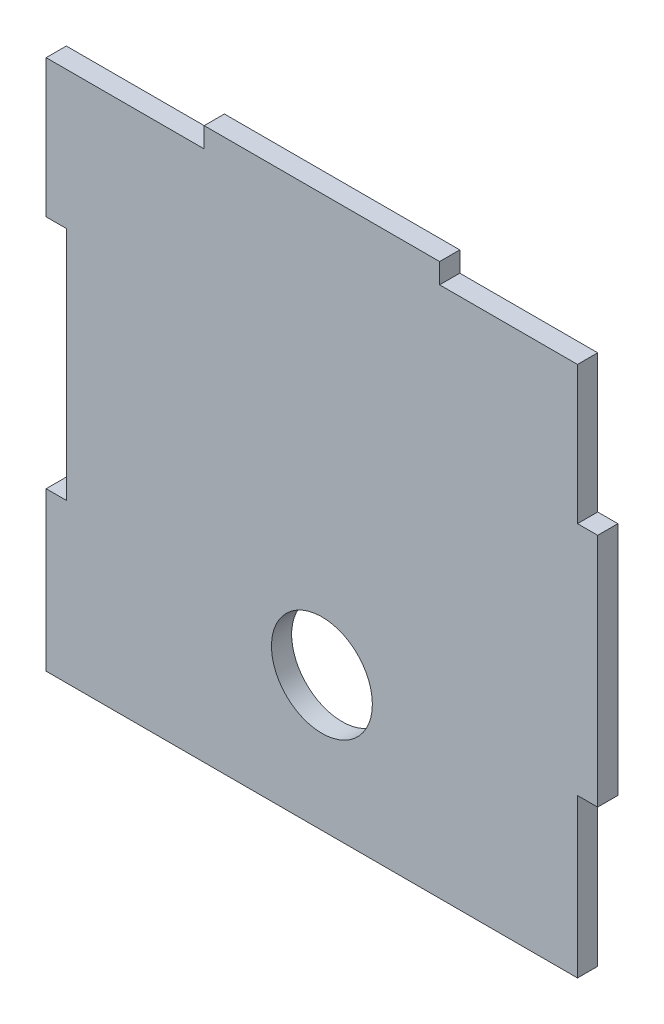
ISO-10303-21;
HEADER;
FILE_DESCRIPTION(('STEP AP214'),'2;1');
FILE_NAME('part.step','',(''),(''),'','','');
FILE_SCHEMA(('AUTOMOTIVE_DESIGN { 1 0 10303 214 1 1 1 1 }'));
ENDSEC;
DATA;
#1=APPLICATION_CONTEXT('core data for automotive mechanical design processes');
#2=APPLICATION_PROTOCOL_DEFINITION('international standard','automotive_design',2000,#1);
#3=PRODUCT_CONTEXT('',#1,'mechanical');
#4=PRODUCT('Part','Part','',(#3));
#5=PRODUCT_RELATED_PRODUCT_CATEGORY('part','',(#4));
#6=PRODUCT_DEFINITION_FORMATION('','',#4);
#7=PRODUCT_DEFINITION_CONTEXT('part definition',#1,'design');
#8=PRODUCT_DEFINITION('design','',#6,#7);
#9=PRODUCT_DEFINITION_SHAPE('','',#8);
#10=(LENGTH_UNIT() NAMED_UNIT(*) SI_UNIT(.MILLI.,.METRE.));
#11=(NAMED_UNIT(*) PLANE_ANGLE_UNIT() SI_UNIT($,.RADIAN.));
#12=(NAMED_UNIT(*) SI_UNIT($,.STERADIAN.) SOLID_ANGLE_UNIT());
#13=UNCERTAINTY_MEASURE_WITH_UNIT(LENGTH_MEASURE(1.E-05),#10,'distance_accuracy_value','');
#14=(GEOMETRIC_REPRESENTATION_CONTEXT(3) GLOBAL_UNCERTAINTY_ASSIGNED_CONTEXT((#13)) GLOBAL_UNIT_ASSIGNED_CONTEXT((#10,
#11,#12)) REPRESENTATION_CONTEXT('',''));
#15=CARTESIAN_POINT('',(0.,0.,0.));
#16=DIRECTION('',(0.,0.,1.));
#17=DIRECTION('',(1.,0.,0.));
#18=AXIS2_PLACEMENT_3D('',#15,#16,#17);
#19=CARTESIAN_POINT('',(38.,-16.,3.));
#20=DIRECTION('',(0.,1.,0.));
#21=DIRECTION('',(-1.,0.,0.));
#22=AXIS2_PLACEMENT_3D('',#19,#20,#21);
#23=PLANE('',#22);
#24=DIRECTION('',(1.,0.,0.));
#25=VECTOR('',#24,1.);
#26=CARTESIAN_POINT('',(38.,-16.,0.));
#27=LINE('',#26,#25);
#28=CARTESIAN_POINT('',(38.,-16.,0.));
#29=VERTEX_POINT('',#28);
#30=CARTESIAN_POINT('',(41.,-16.,0.));
#31=VERTEX_POINT('',#30);
#32=EDGE_CURVE('E187',#29,#31,#27,.T.);
#33=ORIENTED_EDGE('',*,*,#32,.T.);
#34=DIRECTION('',(0.,0.,-1.));
#35=VECTOR('',#34,1.);
#36=CARTESIAN_POINT('',(41.,-16.,3.));
#37=LINE('',#36,#35);
#38=CARTESIAN_POINT('',(41.,-16.,3.));
#39=VERTEX_POINT('',#38);
#40=EDGE_CURVE('E11',#39,#31,#37,.T.);
#41=ORIENTED_EDGE('',*,*,#40,.F.);
#42=DIRECTION('',(1.,0.,0.));
#43=VECTOR('',#42,1.);
#44=CARTESIAN_POINT('',(38.,-16.,3.));
#45=LINE('',#44,#43);
#46=CARTESIAN_POINT('',(38.,-16.,3.));
#47=VERTEX_POINT('',#46);
#48=EDGE_CURVE('E238',#47,#39,#45,.T.);
#49=ORIENTED_EDGE('',*,*,#48,.F.);
#50=DIRECTION('',(0.,0.,-1.));
#51=VECTOR('',#50,1.);
#52=CARTESIAN_POINT('',(38.,-16.,3.));
#53=LINE('',#52,#51);
#54=EDGE_CURVE('E183',#47,#29,#53,.T.);
#55=ORIENTED_EDGE('',*,*,#54,.T.);
#56=EDGE_LOOP('',(#33,#41,#49,#55));
#57=FACE_BOUND('',#56,.T.);
#58=ADVANCED_FACE('F38',(#57),#23,.F.);
#59=CARTESIAN_POINT('',(41.,16.,3.));
#60=DIRECTION('',(-1.,0.,0.));
#61=DIRECTION('',(0.,0.,1.));
#62=AXIS2_PLACEMENT_3D('',#59,#60,#61);
#63=PLANE('',#62);
#64=DIRECTION('',(0.,1.,0.));
#65=VECTOR('',#64,1.);
#66=CARTESIAN_POINT('',(41.,16.,0.));
#67=LINE('',#66,#65);
#68=CARTESIAN_POINT('',(41.,19.,0.));
#69=VERTEX_POINT('',#68);
#70=EDGE_CURVE('E191',#31,#69,#67,.T.);
#71=ORIENTED_EDGE('',*,*,#70,.T.);
#72=DIRECTION('',(0.,0.,-1.));
#73=VECTOR('',#72,1.);
#74=CARTESIAN_POINT('',(41.,19.,3.));
#75=LINE('',#74,#73);
#76=CARTESIAN_POINT('',(41.,19.,3.));
#77=VERTEX_POINT('',#76);
#78=EDGE_CURVE('E47',#77,#69,#75,.T.);
#79=ORIENTED_EDGE('',*,*,#78,.F.);
#80=DIRECTION('',(0.,1.,0.));
#81=VECTOR('',#80,1.);
#82=CARTESIAN_POINT('',(41.,16.,3.));
#83=LINE('',#82,#81);
#84=EDGE_CURVE('E120',#39,#77,#83,.T.);
#85=ORIENTED_EDGE('',*,*,#84,.F.);
#86=ORIENTED_EDGE('',*,*,#40,.T.);
#87=EDGE_LOOP('',(#71,#79,#85,#86));
#88=FACE_BOUND('',#87,.T.);
#89=ADVANCED_FACE('F379',(#88),#63,.F.);
#90=CARTESIAN_POINT('',(41.,19.,3.));
#91=DIRECTION('',(0.,-1.,0.));
#92=DIRECTION('',(0.,0.,-1.));
#93=AXIS2_PLACEMENT_3D('',#90,#91,#92);
#94=PLANE('',#93);
#95=DIRECTION('',(-1.,0.,0.));
#96=VECTOR('',#95,1.);
#97=CARTESIAN_POINT('',(41.,19.,0.));
#98=LINE('',#97,#96);
#99=CARTESIAN_POINT('',(38.,19.,0.));
#100=VERTEX_POINT('',#99);
#101=EDGE_CURVE('E195',#69,#100,#98,.T.);
#102=ORIENTED_EDGE('',*,*,#101,.T.);
#103=DIRECTION('',(0.,0.,-1.));
#104=VECTOR('',#103,1.);
#105=CARTESIAN_POINT('',(38.,19.,3.));
#106=LINE('',#105,#104);
#107=CARTESIAN_POINT('',(38.,19.,3.));
#108=VERTEX_POINT('',#107);
#109=EDGE_CURVE('E281',#108,#100,#106,.T.);
#110=ORIENTED_EDGE('',*,*,#109,.F.);
#111=DIRECTION('',(-1.,0.,0.));
#112=VECTOR('',#111,1.);
#113=CARTESIAN_POINT('',(41.,19.,3.));
#114=LINE('',#113,#112);
#115=EDGE_CURVE('E291',#77,#108,#114,.T.);
#116=ORIENTED_EDGE('',*,*,#115,.F.);
#117=ORIENTED_EDGE('',*,*,#78,.T.);
#118=EDGE_LOOP('',(#102,#110,#116,#117));
#119=FACE_BOUND('',#118,.T.);
#120=ADVANCED_FACE('F289',(#119),#94,.F.);
#121=CARTESIAN_POINT('',(38.,39.5,3.));
#122=DIRECTION('',(-1.,0.,0.));
#123=DIRECTION('',(0.,-1.,0.));
#124=AXIS2_PLACEMENT_3D('',#121,#122,#123);
#125=PLANE('',#124);
#126=DIRECTION('',(0.,1.,0.));
#127=VECTOR('',#126,1.);
#128=CARTESIAN_POINT('',(38.,39.5,0.));
#129=LINE('',#128,#127);
#130=CARTESIAN_POINT('',(38.,39.5,0.));
#131=VERTEX_POINT('',#130);
#132=EDGE_CURVE('E198',#100,#131,#129,.T.);
#133=ORIENTED_EDGE('',*,*,#132,.T.);
#134=DIRECTION('',(0.,0.,-1.));
#135=VECTOR('',#134,1.);
#136=CARTESIAN_POINT('',(38.,39.5,3.));
#137=LINE('',#136,#135);
#138=CARTESIAN_POINT('',(38.,39.5,3.));
#139=VERTEX_POINT('',#138);
#140=EDGE_CURVE('E277',#139,#131,#137,.T.);
#141=ORIENTED_EDGE('',*,*,#140,.F.);
#142=DIRECTION('',(0.,1.,0.));
#143=VECTOR('',#142,1.);
#144=CARTESIAN_POINT('',(38.,39.5,3.));
#145=LINE('',#144,#143);
#146=EDGE_CURVE('E308',#108,#139,#145,.T.);
#147=ORIENTED_EDGE('',*,*,#146,.F.);
#148=ORIENTED_EDGE('',*,*,#109,.T.);
#149=EDGE_LOOP('',(#133,#141,#147,#148));
#150=FACE_BOUND('',#149,.T.);
#151=ADVANCED_FACE('F298',(#150),#125,.F.);
#152=CARTESIAN_POINT('',(17.5,39.5,3.));
#153=DIRECTION('',(0.,-1.,0.));
#154=DIRECTION('',(1.,0.,0.));
#155=AXIS2_PLACEMENT_3D('',#152,#153,#154);
#156=PLANE('',#155);
#157=DIRECTION('',(-1.,0.,0.));
#158=VECTOR('',#157,1.);
#159=CARTESIAN_POINT('',(17.5,39.5,0.));
#160=LINE('',#159,#158);
#161=CARTESIAN_POINT('',(17.5,39.5,0.));
#162=VERTEX_POINT('',#161);
#163=EDGE_CURVE('E201',#131,#162,#160,.T.);
#164=ORIENTED_EDGE('',*,*,#163,.T.);
#165=DIRECTION('',(0.,0.,-1.));
#166=VECTOR('',#165,1.);
#167=CARTESIAN_POINT('',(17.5,39.5,3.));
#168=LINE('',#167,#166);
#169=CARTESIAN_POINT('',(17.5,39.5,3.));
#170=VERTEX_POINT('',#169);
#171=EDGE_CURVE('E273',#170,#162,#168,.T.);
#172=ORIENTED_EDGE('',*,*,#171,.F.);
#173=DIRECTION('',(-1.,0.,0.));
#174=VECTOR('',#173,1.);
#175=CARTESIAN_POINT('',(17.5,39.5,3.));
#176=LINE('',#175,#174);
#177=EDGE_CURVE('E304',#139,#170,#176,.T.);
#178=ORIENTED_EDGE('',*,*,#177,.F.);
#179=ORIENTED_EDGE('',*,*,#140,.T.);
#180=EDGE_LOOP('',(#164,#172,#178,#179));
#181=FACE_BOUND('',#180,.T.);
#182=ADVANCED_FACE('F302',(#181),#156,.F.);
#183=CARTESIAN_POINT('',(17.5,42.5,3.));
#184=DIRECTION('',(-1.,0.,0.));
#185=DIRECTION('',(0.,-1.,0.));
#186=AXIS2_PLACEMENT_3D('',#183,#184,#185);
#187=PLANE('',#186);
#188=DIRECTION('',(0.,1.,0.));
#189=VECTOR('',#188,1.);
#190=CARTESIAN_POINT('',(17.5,42.5,0.));
#191=LINE('',#190,#189);
#192=CARTESIAN_POINT('',(17.5,42.5,0.));
#193=VERTEX_POINT('',#192);
#194=EDGE_CURVE('E204',#162,#193,#191,.T.);
#195=ORIENTED_EDGE('',*,*,#194,.T.);
#196=DIRECTION('',(0.,0.,-1.));
#197=VECTOR('',#196,1.);
#198=CARTESIAN_POINT('',(17.5,42.5,3.));
#199=LINE('',#198,#197);
#200=CARTESIAN_POINT('',(17.5,42.5,3.));
#201=VERTEX_POINT('',#200);
#202=EDGE_CURVE('E269',#201,#193,#199,.T.);
#203=ORIENTED_EDGE('',*,*,#202,.F.);
#204=DIRECTION('',(0.,1.,0.));
#205=VECTOR('',#204,1.);
#206=CARTESIAN_POINT('',(17.5,42.5,3.));
#207=LINE('',#206,#205);
#208=EDGE_CURVE('E307',#170,#201,#207,.T.);
#209=ORIENTED_EDGE('',*,*,#208,.F.);
#210=ORIENTED_EDGE('',*,*,#171,.T.);
#211=EDGE_LOOP('',(#195,#203,#209,#210));
#212=FACE_BOUND('',#211,.T.);
#213=ADVANCED_FACE('F392',(#212),#187,.F.);
#214=CARTESIAN_POINT('',(-17.5,42.5,3.));
#215=DIRECTION('',(0.,-1.,0.));
#216=DIRECTION('',(0.,0.,-1.));
#217=AXIS2_PLACEMENT_3D('',#214,#215,#216);
#218=PLANE('',#217);
#219=DIRECTION('',(-1.,0.,0.));
#220=VECTOR('',#219,1.);
#221=CARTESIAN_POINT('',(-17.5,42.5,0.));
#222=LINE('',#221,#220);
#223=CARTESIAN_POINT('',(-17.5,42.5,0.));
#224=VERTEX_POINT('',#223);
#225=EDGE_CURVE('E207',#193,#224,#222,.T.);
#226=ORIENTED_EDGE('',*,*,#225,.T.);
#227=DIRECTION('',(0.,0.,-1.));
#228=VECTOR('',#227,1.);
#229=CARTESIAN_POINT('',(-17.5,42.5,3.));
#230=LINE('',#229,#228);
#231=CARTESIAN_POINT('',(-17.5,42.5,3.));
#232=VERTEX_POINT('',#231);
#233=EDGE_CURVE('E265',#232,#224,#230,.T.);
#234=ORIENTED_EDGE('',*,*,#233,.F.);
#235=DIRECTION('',(-1.,0.,0.));
#236=VECTOR('',#235,1.);
#237=CARTESIAN_POINT('',(-17.5,42.5,3.));
#238=LINE('',#237,#236);
#239=EDGE_CURVE('E312',#201,#232,#238,.T.);
#240=ORIENTED_EDGE('',*,*,#239,.F.);
#241=ORIENTED_EDGE('',*,*,#202,.T.);
#242=EDGE_LOOP('',(#226,#234,#240,#241));
#243=FACE_BOUND('',#242,.T.);
#244=ADVANCED_FACE('F395',(#243),#218,.F.);
#245=CARTESIAN_POINT('',(-17.5,39.5,3.));
#246=DIRECTION('',(1.,0.,0.));
#247=DIRECTION('',(0.,0.,-1.));
#248=AXIS2_PLACEMENT_3D('',#245,#246,#247);
#249=PLANE('',#248);
#250=DIRECTION('',(0.,-1.,0.));
#251=VECTOR('',#250,1.);
#252=CARTESIAN_POINT('',(-17.5,39.5,0.));
#253=LINE('',#252,#251);
#254=CARTESIAN_POINT('',(-17.5,39.5,0.));
#255=VERTEX_POINT('',#254);
#256=EDGE_CURVE('E210',#224,#255,#253,.T.);
#257=ORIENTED_EDGE('',*,*,#256,.T.);
#258=DIRECTION('',(0.,0.,-1.));
#259=VECTOR('',#258,1.);
#260=CARTESIAN_POINT('',(-17.5,39.5,3.));
#261=LINE('',#260,#259);
#262=CARTESIAN_POINT('',(-17.5,39.5,3.));
#263=VERTEX_POINT('',#262);
#264=EDGE_CURVE('E261',#263,#255,#261,.T.);
#265=ORIENTED_EDGE('',*,*,#264,.F.);
#266=DIRECTION('',(0.,-1.,0.));
#267=VECTOR('',#266,1.);
#268=CARTESIAN_POINT('',(-17.5,39.5,3.));
#269=LINE('',#268,#267);
#270=EDGE_CURVE('E319',#232,#263,#269,.T.);
#271=ORIENTED_EDGE('',*,*,#270,.F.);
#272=ORIENTED_EDGE('',*,*,#233,.T.);
#273=EDGE_LOOP('',(#257,#265,#271,#272));
#274=FACE_BOUND('',#273,.T.);
#275=ADVANCED_FACE('F399',(#274),#249,.F.);
#276=CARTESIAN_POINT('',(-41.,39.5,3.));
#277=DIRECTION('',(0.,-1.,0.));
#278=DIRECTION('',(0.,0.,-1.));
#279=AXIS2_PLACEMENT_3D('',#276,#277,#278);
#280=PLANE('',#279);
#281=DIRECTION('',(-1.,0.,0.));
#282=VECTOR('',#281,1.);
#283=CARTESIAN_POINT('',(-41.,39.5,0.));
#284=LINE('',#283,#282);
#285=CARTESIAN_POINT('',(-41.,39.5,0.));
#286=VERTEX_POINT('',#285);
#287=EDGE_CURVE('E214',#255,#286,#284,.T.);
#288=ORIENTED_EDGE('',*,*,#287,.T.);
#289=DIRECTION('',(0.,0.,-1.));
#290=VECTOR('',#289,1.);
#291=CARTESIAN_POINT('',(-41.,39.5,3.));
#292=LINE('',#291,#290);
#293=CARTESIAN_POINT('',(-41.,39.5,3.));
#294=VERTEX_POINT('',#293);
#295=EDGE_CURVE('E257',#294,#286,#292,.T.);
#296=ORIENTED_EDGE('',*,*,#295,.F.);
#297=DIRECTION('',(-1.,0.,0.));
#298=VECTOR('',#297,1.);
#299=CARTESIAN_POINT('',(-38.,39.5,3.));
#300=LINE('',#299,#298);
#301=EDGE_CURVE('E322',#263,#294,#300,.T.);
#302=ORIENTED_EDGE('',*,*,#301,.F.);
#303=ORIENTED_EDGE('',*,*,#264,.T.);
#304=EDGE_LOOP('',(#288,#296,#302,#303));
#305=FACE_BOUND('',#304,.T.);
#306=ADVANCED_FACE('F403',(#305),#280,.F.);
#307=CARTESIAN_POINT('',(-41.,19.,3.));
#308=DIRECTION('',(1.,0.,0.));
#309=DIRECTION('',(0.,1.,0.));
#310=AXIS2_PLACEMENT_3D('',#307,#308,#309);
#311=PLANE('',#310);
#312=DIRECTION('',(0.,-1.,0.));
#313=VECTOR('',#312,1.);
#314=CARTESIAN_POINT('',(-41.,19.,0.));
#315=LINE('',#314,#313);
#316=CARTESIAN_POINT('',(-41.,19.,0.));
#317=VERTEX_POINT('',#316);
#318=EDGE_CURVE('E217',#286,#317,#315,.T.);
#319=ORIENTED_EDGE('',*,*,#318,.T.);
#320=DIRECTION('',(0.,0.,-1.));
#321=VECTOR('',#320,1.);
#322=CARTESIAN_POINT('',(-41.,19.,3.));
#323=LINE('',#322,#321);
#324=CARTESIAN_POINT('',(-41.,19.,3.));
#325=VERTEX_POINT('',#324);
#326=EDGE_CURVE('E253',#325,#317,#323,.T.);
#327=ORIENTED_EDGE('',*,*,#326,.F.);
#328=DIRECTION('',(0.,-1.,0.));
#329=VECTOR('',#328,1.);
#330=CARTESIAN_POINT('',(-41.,19.,3.));
#331=LINE('',#330,#329);
#332=EDGE_CURVE('E325',#294,#325,#331,.T.);
#333=ORIENTED_EDGE('',*,*,#332,.F.);
#334=ORIENTED_EDGE('',*,*,#295,.T.);
#335=EDGE_LOOP('',(#319,#327,#333,#334));
#336=FACE_BOUND('',#335,.T.);
#337=ADVANCED_FACE('F407',(#336),#311,.F.);
#338=CARTESIAN_POINT('',(-38.,19.,3.));
#339=DIRECTION('',(0.,1.,0.));
#340=DIRECTION('',(-1.,0.,0.));
#341=AXIS2_PLACEMENT_3D('',#338,#339,#340);
#342=PLANE('',#341);
#343=DIRECTION('',(1.,0.,0.));
#344=VECTOR('',#343,1.);
#345=CARTESIAN_POINT('',(-38.,19.,0.));
#346=LINE('',#345,#344);
#347=CARTESIAN_POINT('',(-38.,19.,0.));
#348=VERTEX_POINT('',#347);
#349=EDGE_CURVE('E220',#317,#348,#346,.T.);
#350=ORIENTED_EDGE('',*,*,#349,.T.);
#351=DIRECTION('',(0.,0.,-1.));
#352=VECTOR('',#351,1.);
#353=CARTESIAN_POINT('',(-38.,19.,3.));
#354=LINE('',#353,#352);
#355=CARTESIAN_POINT('',(-38.,19.,3.));
#356=VERTEX_POINT('',#355);
#357=EDGE_CURVE('E249',#356,#348,#354,.T.);
#358=ORIENTED_EDGE('',*,*,#357,.F.);
#359=DIRECTION('',(1.,0.,0.));
#360=VECTOR('',#359,1.);
#361=CARTESIAN_POINT('',(-38.,19.,3.));
#362=LINE('',#361,#360);
#363=EDGE_CURVE('E328',#325,#356,#362,.T.);
#364=ORIENTED_EDGE('',*,*,#363,.F.);
#365=ORIENTED_EDGE('',*,*,#326,.T.);
#366=EDGE_LOOP('',(#350,#358,#364,#365));
#367=FACE_BOUND('',#366,.T.);
#368=ADVANCED_FACE('F411',(#367),#342,.F.);
#369=CARTESIAN_POINT('',(-38.,16.,3.));
#370=DIRECTION('',(1.,0.,0.));
#371=DIRECTION('',(0.,0.,-1.));
#372=AXIS2_PLACEMENT_3D('',#369,#370,#371);
#373=PLANE('',#372);
#374=DIRECTION('',(0.,-1.,0.));
#375=VECTOR('',#374,1.);
#376=CARTESIAN_POINT('',(-38.,16.,0.));
#377=LINE('',#376,#375);
#378=CARTESIAN_POINT('',(-38.,-16.,0.));
#379=VERTEX_POINT('',#378);
#380=EDGE_CURVE('E224',#348,#379,#377,.T.);
#381=ORIENTED_EDGE('',*,*,#380,.T.);
#382=DIRECTION('',(0.,0.,-1.));
#383=VECTOR('',#382,1.);
#384=CARTESIAN_POINT('',(-38.,-16.,3.));
#385=LINE('',#384,#383);
#386=CARTESIAN_POINT('',(-38.,-16.,3.));
#387=VERTEX_POINT('',#386);
#388=EDGE_CURVE('E245',#387,#379,#385,.T.);
#389=ORIENTED_EDGE('',*,*,#388,.F.);
#390=DIRECTION('',(0.,-1.,0.));
#391=VECTOR('',#390,1.);
#392=CARTESIAN_POINT('',(-38.,16.,3.));
#393=LINE('',#392,#391);
#394=EDGE_CURVE('E331',#356,#387,#393,.T.);
#395=ORIENTED_EDGE('',*,*,#394,.F.);
#396=ORIENTED_EDGE('',*,*,#357,.T.);
#397=EDGE_LOOP('',(#381,#389,#395,#396));
#398=FACE_BOUND('',#397,.T.);
#399=ADVANCED_FACE('F339',(#398),#373,.F.);
#400=CARTESIAN_POINT('',(-41.,-16.,3.));
#401=DIRECTION('',(0.,-1.,0.));
#402=DIRECTION('',(0.,0.,-1.));
#403=AXIS2_PLACEMENT_3D('',#400,#401,#402);
#404=PLANE('',#403);
#405=DIRECTION('',(-1.,0.,0.));
#406=VECTOR('',#405,1.);
#407=CARTESIAN_POINT('',(-41.,-16.,0.));
#408=LINE('',#407,#406);
#409=CARTESIAN_POINT('',(-41.,-16.,0.));
#410=VERTEX_POINT('',#409);
#411=EDGE_CURVE('E227',#379,#410,#408,.T.);
#412=ORIENTED_EDGE('',*,*,#411,.T.);
#413=DIRECTION('',(0.,0.,-1.));
#414=VECTOR('',#413,1.);
#415=CARTESIAN_POINT('',(-41.,-16.,3.));
#416=LINE('',#415,#414);
#417=CARTESIAN_POINT('',(-41.,-16.,3.));
#418=VERTEX_POINT('',#417);
#419=EDGE_CURVE('E176',#418,#410,#416,.T.);
#420=ORIENTED_EDGE('',*,*,#419,.F.);
#421=DIRECTION('',(-1.,0.,0.));
#422=VECTOR('',#421,1.);
#423=CARTESIAN_POINT('',(-41.,-16.,3.));
#424=LINE('',#423,#422);
#425=EDGE_CURVE('E164',#387,#418,#424,.T.);
#426=ORIENTED_EDGE('',*,*,#425,.F.);
#427=ORIENTED_EDGE('',*,*,#388,.T.);
#428=EDGE_LOOP('',(#412,#420,#426,#427));
#429=FACE_BOUND('',#428,.T.);
#430=ADVANCED_FACE('F342',(#429),#404,.F.);
#431=CARTESIAN_POINT('',(-41.,-19.,3.));
#432=DIRECTION('',(1.,0.,0.));
#433=DIRECTION('',(0.,1.,0.));
#434=AXIS2_PLACEMENT_3D('',#431,#432,#433);
#435=PLANE('',#434);
#436=DIRECTION('',(0.,-1.,0.));
#437=VECTOR('',#436,1.);
#438=CARTESIAN_POINT('',(-41.,-19.,0.));
#439=LINE('',#438,#437);
#440=CARTESIAN_POINT('',(-41.,-39.5,0.));
#441=VERTEX_POINT('',#440);
#442=EDGE_CURVE('E173',#410,#441,#439,.T.);
#443=ORIENTED_EDGE('',*,*,#442,.T.);
#444=DIRECTION('',(0.,0.,-1.));
#445=VECTOR('',#444,1.);
#446=CARTESIAN_POINT('',(-41.,-39.5,3.));
#447=LINE('',#446,#445);
#448=CARTESIAN_POINT('',(-41.,-39.5,3.));
#449=VERTEX_POINT('',#448);
#450=EDGE_CURVE('E171',#449,#441,#447,.T.);
#451=ORIENTED_EDGE('',*,*,#450,.F.);
#452=DIRECTION('',(0.,-1.,0.));
#453=VECTOR('',#452,1.);
#454=CARTESIAN_POINT('',(-41.,-19.,3.));
#455=LINE('',#454,#453);
#456=EDGE_CURVE('E157',#418,#449,#455,.T.);
#457=ORIENTED_EDGE('',*,*,#456,.F.);
#458=ORIENTED_EDGE('',*,*,#419,.T.);
#459=EDGE_LOOP('',(#443,#451,#457,#458));
#460=FACE_BOUND('',#459,.T.);
#461=ADVANCED_FACE('F172',(#460),#435,.F.);
#462=CARTESIAN_POINT('',(-41.,-39.5,3.));
#463=DIRECTION('',(0.,1.,0.));
#464=DIRECTION('',(0.,0.,1.));
#465=AXIS2_PLACEMENT_3D('',#462,#463,#464);
#466=PLANE('',#465);
#467=DIRECTION('',(1.,0.,0.));
#468=VECTOR('',#467,1.);
#469=CARTESIAN_POINT('',(-41.,-39.5,0.));
#470=LINE('',#469,#468);
#471=CARTESIAN_POINT('',(38.,-39.5,0.));
#472=VERTEX_POINT('',#471);
#473=EDGE_CURVE('E233',#441,#472,#470,.T.);
#474=ORIENTED_EDGE('',*,*,#473,.T.);
#475=DIRECTION('',(0.,0.,-1.));
#476=VECTOR('',#475,1.);
#477=CARTESIAN_POINT('',(38.,-39.5,3.));
#478=LINE('',#477,#476);
#479=CARTESIAN_POINT('',(38.,-39.5,3.));
#480=VERTEX_POINT('',#479);
#481=EDGE_CURVE('E177',#480,#472,#478,.T.);
#482=ORIENTED_EDGE('',*,*,#481,.F.);
#483=DIRECTION('',(1.,0.,0.));
#484=VECTOR('',#483,1.);
#485=CARTESIAN_POINT('',(-41.,-39.5,3.));
#486=LINE('',#485,#484);
#487=EDGE_CURVE('E161',#449,#480,#486,.T.);
#488=ORIENTED_EDGE('',*,*,#487,.F.);
#489=ORIENTED_EDGE('',*,*,#450,.T.);
#490=EDGE_LOOP('',(#474,#482,#488,#489));
#491=FACE_BOUND('',#490,.T.);
#492=ADVANCED_FACE('F179',(#491),#466,.F.);
#493=CARTESIAN_POINT('',(38.,-19.,3.));
#494=DIRECTION('',(-1.,0.,0.));
#495=DIRECTION('',(0.,-1.,0.));
#496=AXIS2_PLACEMENT_3D('',#493,#494,#495);
#497=PLANE('',#496);
#498=DIRECTION('',(0.,1.,0.));
#499=VECTOR('',#498,1.);
#500=CARTESIAN_POINT('',(38.,-19.,0.));
#501=LINE('',#500,#499);
#502=EDGE_CURVE('E108',#472,#29,#501,.T.);
#503=ORIENTED_EDGE('',*,*,#502,.T.);
#504=ORIENTED_EDGE('',*,*,#54,.F.);
#505=DIRECTION('',(0.,1.,0.));
#506=VECTOR('',#505,1.);
#507=CARTESIAN_POINT('',(38.,-19.,3.));
#508=LINE('',#507,#506);
#509=EDGE_CURVE('E55',#480,#47,#508,.T.);
#510=ORIENTED_EDGE('',*,*,#509,.F.);
#511=ORIENTED_EDGE('',*,*,#481,.T.);
#512=EDGE_LOOP('',(#503,#504,#510,#511));
#513=FACE_BOUND('',#512,.T.);
#514=ADVANCED_FACE('F344',(#513),#497,.F.);
#515=CARTESIAN_POINT('',(0.,0.,3.));
#516=DIRECTION('',(0.,0.,-1.));
#517=DIRECTION('',(-1.,0.,0.));
#518=AXIS2_PLACEMENT_3D('',#515,#516,#517);
#519=PLANE('',#518);
#520=CARTESIAN_POINT('',(0.,-19.5,3.));
#521=DIRECTION('',(0.,0.,1.));
#522=DIRECTION('',(1.,0.,0.));
#523=AXIS2_PLACEMENT_3D('',#520,#521,#522);
#524=CIRCLE('',#523,7.5);
#525=CARTESIAN_POINT('',(7.5,-19.5,3.));
#526=VERTEX_POINT('',#525);
#527=EDGE_CURVE('E353',#526,#526,#524,.T.);
#528=ORIENTED_EDGE('',*,*,#527,.F.);
#529=EDGE_LOOP('',(#528));
#530=FACE_BOUND('',#529,.T.);
#531=ORIENTED_EDGE('',*,*,#48,.T.);
#532=ORIENTED_EDGE('',*,*,#84,.T.);
#533=ORIENTED_EDGE('',*,*,#115,.T.);
#534=ORIENTED_EDGE('',*,*,#146,.T.);
#535=ORIENTED_EDGE('',*,*,#177,.T.);
#536=ORIENTED_EDGE('',*,*,#208,.T.);
#537=ORIENTED_EDGE('',*,*,#239,.T.);
#538=ORIENTED_EDGE('',*,*,#270,.T.);
#539=ORIENTED_EDGE('',*,*,#301,.T.);
#540=ORIENTED_EDGE('',*,*,#332,.T.);
#541=ORIENTED_EDGE('',*,*,#363,.T.);
#542=ORIENTED_EDGE('',*,*,#394,.T.);
#543=ORIENTED_EDGE('',*,*,#425,.T.);
#544=ORIENTED_EDGE('',*,*,#456,.T.);
#545=ORIENTED_EDGE('',*,*,#487,.T.);
#546=ORIENTED_EDGE('',*,*,#509,.T.);
#547=EDGE_LOOP('',(#531,#532,#533,#534,#535,#536,#537,#538,#539,#540,#541,#542,#543,#544,#545,#546));
#548=FACE_BOUND('',#547,.T.);
#549=ADVANCED_FACE('F159',(#530,#548),#519,.F.);
#550=CARTESIAN_POINT('',(0.,0.,0.));
#551=DIRECTION('',(0.,0.,-1.));
#552=DIRECTION('',(-1.,0.,0.));
#553=AXIS2_PLACEMENT_3D('',#550,#551,#552);
#554=PLANE('',#553);
#555=CARTESIAN_POINT('',(0.,-19.5,0.));
#556=DIRECTION('',(0.,0.,1.));
#557=DIRECTION('',(1.,0.,0.));
#558=AXIS2_PLACEMENT_3D('',#555,#556,#557);
#559=CIRCLE('',#558,7.5);
#560=CARTESIAN_POINT('',(7.5,-19.5,0.));
#561=VERTEX_POINT('',#560);
#562=EDGE_CURVE('E192',#561,#561,#559,.T.);
#563=ORIENTED_EDGE('',*,*,#562,.T.);
#564=EDGE_LOOP('',(#563));
#565=FACE_BOUND('',#564,.T.);
#566=ORIENTED_EDGE('',*,*,#32,.F.);
#567=ORIENTED_EDGE('',*,*,#502,.F.);
#568=ORIENTED_EDGE('',*,*,#473,.F.);
#569=ORIENTED_EDGE('',*,*,#442,.F.);
#570=ORIENTED_EDGE('',*,*,#411,.F.);
#571=ORIENTED_EDGE('',*,*,#380,.F.);
#572=ORIENTED_EDGE('',*,*,#349,.F.);
#573=ORIENTED_EDGE('',*,*,#318,.F.);
#574=ORIENTED_EDGE('',*,*,#287,.F.);
#575=ORIENTED_EDGE('',*,*,#256,.F.);
#576=ORIENTED_EDGE('',*,*,#225,.F.);
#577=ORIENTED_EDGE('',*,*,#194,.F.);
#578=ORIENTED_EDGE('',*,*,#163,.F.);
#579=ORIENTED_EDGE('',*,*,#132,.F.);
#580=ORIENTED_EDGE('',*,*,#101,.F.);
#581=ORIENTED_EDGE('',*,*,#70,.F.);
#582=EDGE_LOOP('',(#566,#567,#568,#569,#570,#571,#572,#573,#574,#575,#576,#577,#578,#579,#580,#581));
#583=FACE_BOUND('',#582,.T.);
#584=ADVANCED_FACE('F293',(#565,#583),#554,.T.);
#585=CARTESIAN_POINT('',(0.,-19.5,0.));
#586=DIRECTION('',(0.,0.,1.));
#587=DIRECTION('',(1.,0.,0.));
#588=AXIS2_PLACEMENT_3D('',#585,#586,#587);
#589=CYLINDRICAL_SURFACE('',#588,7.5);
#590=ORIENTED_EDGE('',*,*,#562,.F.);
#591=EDGE_LOOP('',(#590));
#592=FACE_BOUND('',#591,.T.);
#593=ORIENTED_EDGE('',*,*,#527,.T.);
#594=EDGE_LOOP('',(#593));
#595=FACE_BOUND('',#594,.T.);
#596=ADVANCED_FACE('F363',(#592,#595),#589,.F.);
#597=CLOSED_SHELL('',(#58,#89,#120,#151,#182,#213,#244,#275,#306,#337,#368,#399,#430,#461,#492,
#514,#549,#584,#596));
#598=MANIFOLD_SOLID_BREP('B2',#597);
#599=ADVANCED_BREP_SHAPE_REPRESENTATION('',(#18,#598),#14);
#600=SHAPE_DEFINITION_REPRESENTATION(#9,#599);
ENDSEC;
END-ISO-10303-21;
